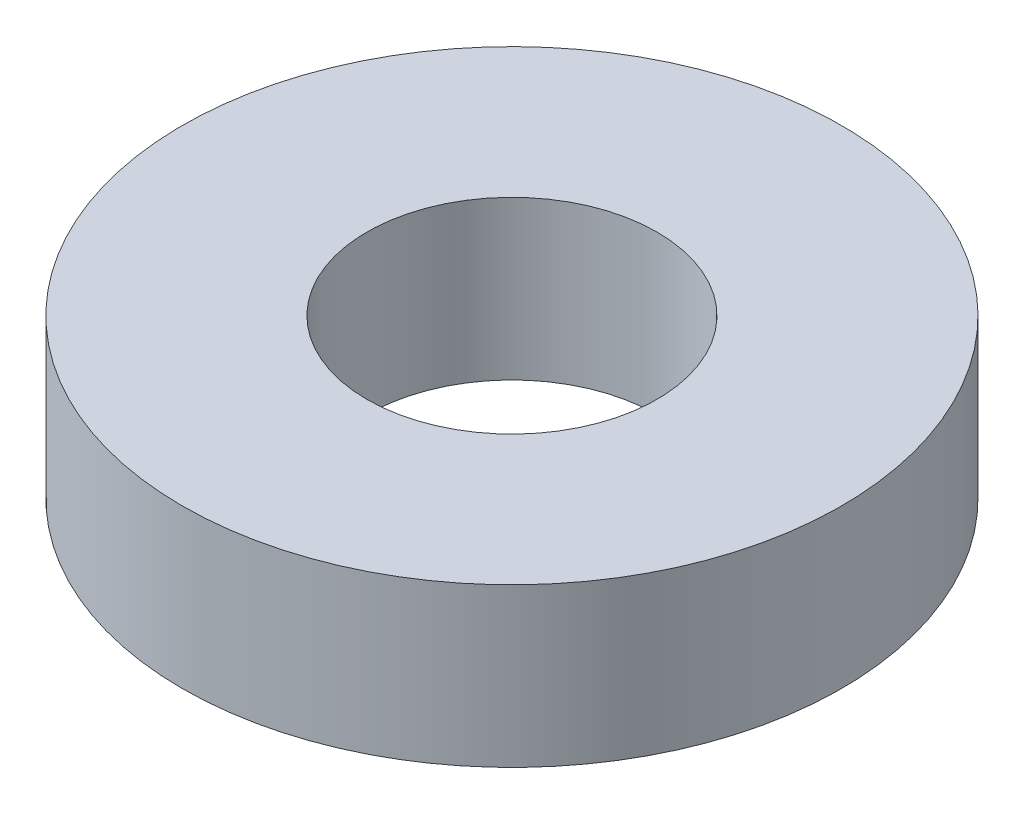
ISO-10303-21;
HEADER;
FILE_DESCRIPTION(('STEP AP214'),'2;1');
FILE_NAME('part.step','',(''),(''),'','','');
FILE_SCHEMA(('AUTOMOTIVE_DESIGN { 1 0 10303 214 1 1 1 1 }'));
ENDSEC;
DATA;
#1=APPLICATION_CONTEXT('core data for automotive mechanical design processes');
#2=APPLICATION_PROTOCOL_DEFINITION('international standard','automotive_design',2000,#1);
#3=PRODUCT_CONTEXT('',#1,'mechanical');
#4=PRODUCT('Part','Part','',(#3));
#5=PRODUCT_RELATED_PRODUCT_CATEGORY('part','',(#4));
#6=PRODUCT_DEFINITION_FORMATION('','',#4);
#7=PRODUCT_DEFINITION_CONTEXT('part definition',#1,'design');
#8=PRODUCT_DEFINITION('design','',#6,#7);
#9=PRODUCT_DEFINITION_SHAPE('','',#8);
#10=(LENGTH_UNIT() NAMED_UNIT(*) SI_UNIT(.MILLI.,.METRE.));
#11=(NAMED_UNIT(*) PLANE_ANGLE_UNIT() SI_UNIT($,.RADIAN.));
#12=(NAMED_UNIT(*) SI_UNIT($,.STERADIAN.) SOLID_ANGLE_UNIT());
#13=UNCERTAINTY_MEASURE_WITH_UNIT(LENGTH_MEASURE(1.E-05),#10,'distance_accuracy_value','');
#14=(GEOMETRIC_REPRESENTATION_CONTEXT(3) GLOBAL_UNCERTAINTY_ASSIGNED_CONTEXT((#13)) GLOBAL_UNIT_ASSIGNED_CONTEXT((#10,
#11,#12)) REPRESENTATION_CONTEXT('',''));
#15=CARTESIAN_POINT('',(0.,0.,0.));
#16=DIRECTION('',(0.,0.,1.));
#17=DIRECTION('',(1.,0.,0.));
#18=AXIS2_PLACEMENT_3D('',#15,#16,#17);
#19=CARTESIAN_POINT('',(0.,30.,0.));
#20=DIRECTION('',(0.,-1.,0.));
#21=DIRECTION('',(0.,0.,-1.));
#22=AXIS2_PLACEMENT_3D('',#19,#20,#21);
#23=CYLINDRICAL_SURFACE('',#22,62.5);
#24=CARTESIAN_POINT('',(0.,30.,0.));
#25=DIRECTION('',(0.,1.,0.));
#26=DIRECTION('',(0.,0.,1.));
#27=AXIS2_PLACEMENT_3D('',#24,#25,#26);
#28=CIRCLE('',#27,62.5);
#29=CARTESIAN_POINT('',(0.,30.,62.5));
#30=VERTEX_POINT('',#29);
#31=EDGE_CURVE('E10',#30,#30,#28,.T.);
#32=ORIENTED_EDGE('',*,*,#31,.F.);
#33=EDGE_LOOP('',(#32));
#34=FACE_BOUND('',#33,.T.);
#35=CARTESIAN_POINT('',(0.,0.,0.));
#36=DIRECTION('',(0.,1.,0.));
#37=DIRECTION('',(0.,0.,1.));
#38=AXIS2_PLACEMENT_3D('',#35,#36,#37);
#39=CIRCLE('',#38,62.5);
#40=CARTESIAN_POINT('',(0.,0.,62.5));
#41=VERTEX_POINT('',#40);
#42=EDGE_CURVE('E37',#41,#41,#39,.T.);
#43=ORIENTED_EDGE('',*,*,#42,.T.);
#44=EDGE_LOOP('',(#43));
#45=FACE_BOUND('',#44,.T.);
#46=ADVANCED_FACE('F40',(#34,#45),#23,.T.);
#47=CARTESIAN_POINT('',(0.,30.,0.));
#48=DIRECTION('',(0.,1.,0.));
#49=DIRECTION('',(0.,0.,1.));
#50=AXIS2_PLACEMENT_3D('',#47,#48,#49);
#51=PLANE('',#50);
#52=CARTESIAN_POINT('',(0.,30.,0.));
#53=DIRECTION('',(0.,1.,0.));
#54=DIRECTION('',(0.,0.,1.));
#55=AXIS2_PLACEMENT_3D('',#52,#53,#54);
#56=CIRCLE('',#55,27.5);
#57=CARTESIAN_POINT('',(0.,30.,27.5));
#58=VERTEX_POINT('',#57);
#59=EDGE_CURVE('E50',#58,#58,#56,.T.);
#60=ORIENTED_EDGE('',*,*,#59,.F.);
#61=EDGE_LOOP('',(#60));
#62=FACE_BOUND('',#61,.T.);
#63=ORIENTED_EDGE('',*,*,#31,.T.);
#64=EDGE_LOOP('',(#63));
#65=FACE_BOUND('',#64,.T.);
#66=ADVANCED_FACE('F59',(#62,#65),#51,.T.);
#67=CARTESIAN_POINT('',(0.,0.,0.));
#68=DIRECTION('',(0.,1.,0.));
#69=DIRECTION('',(0.,0.,1.));
#70=AXIS2_PLACEMENT_3D('',#67,#68,#69);
#71=PLANE('',#70);
#72=CARTESIAN_POINT('',(0.,0.,0.));
#73=DIRECTION('',(0.,1.,0.));
#74=DIRECTION('',(0.,0.,1.));
#75=AXIS2_PLACEMENT_3D('',#72,#73,#74);
#76=CIRCLE('',#75,27.5);
#77=CARTESIAN_POINT('',(0.,0.,27.5));
#78=VERTEX_POINT('',#77);
#79=EDGE_CURVE('E47',#78,#78,#76,.T.);
#80=ORIENTED_EDGE('',*,*,#79,.T.);
#81=EDGE_LOOP('',(#80));
#82=FACE_BOUND('',#81,.T.);
#83=ORIENTED_EDGE('',*,*,#42,.F.);
#84=EDGE_LOOP('',(#83));
#85=FACE_BOUND('',#84,.T.);
#86=ADVANCED_FACE('F58',(#82,#85),#71,.F.);
#87=CARTESIAN_POINT('',(0.,30.,0.));
#88=DIRECTION('',(0.,-1.,0.));
#89=DIRECTION('',(0.,0.,-1.));
#90=AXIS2_PLACEMENT_3D('',#87,#88,#89);
#91=CYLINDRICAL_SURFACE('',#90,27.5);
#92=ORIENTED_EDGE('',*,*,#59,.T.);
#93=EDGE_LOOP('',(#92));
#94=FACE_BOUND('',#93,.T.);
#95=ORIENTED_EDGE('',*,*,#79,.F.);
#96=EDGE_LOOP('',(#95));
#97=FACE_BOUND('',#96,.T.);
#98=ADVANCED_FACE('F54',(#94,#97),#91,.F.);
#99=CLOSED_SHELL('',(#46,#66,#86,#98));
#100=MANIFOLD_SOLID_BREP('B2',#99);
#101=ADVANCED_BREP_SHAPE_REPRESENTATION('',(#18,#100),#14);
#102=SHAPE_DEFINITION_REPRESENTATION(#9,#101);
ENDSEC;
END-ISO-10303-21;
